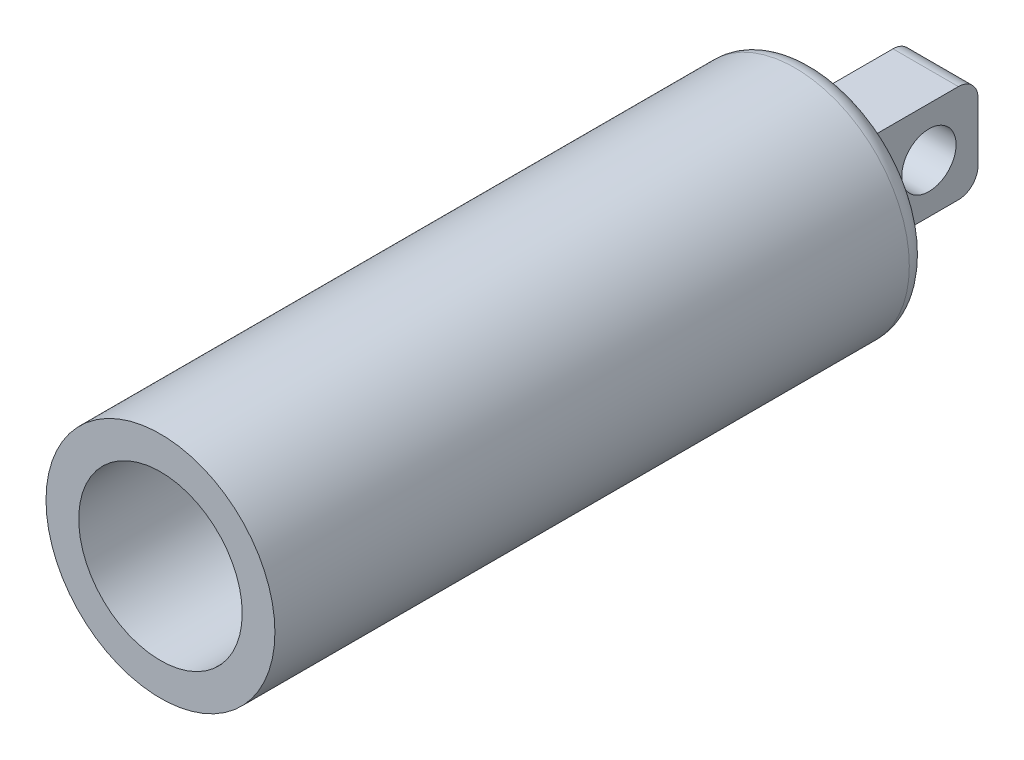
ISO-10303-21;
HEADER;
FILE_DESCRIPTION(('STEP AP214'),'2;1');
FILE_NAME('part.step','',(''),(''),'','','');
FILE_SCHEMA(('AUTOMOTIVE_DESIGN { 1 0 10303 214 1 1 1 1 }'));
ENDSEC;
DATA;
#1=APPLICATION_CONTEXT('core data for automotive mechanical design processes');
#2=APPLICATION_PROTOCOL_DEFINITION('international standard','automotive_design',2000,#1);
#3=PRODUCT_CONTEXT('',#1,'mechanical');
#4=PRODUCT('Part','Part','',(#3));
#5=PRODUCT_RELATED_PRODUCT_CATEGORY('part','',(#4));
#6=PRODUCT_DEFINITION_FORMATION('','',#4);
#7=PRODUCT_DEFINITION_CONTEXT('part definition',#1,'design');
#8=PRODUCT_DEFINITION('design','',#6,#7);
#9=PRODUCT_DEFINITION_SHAPE('','',#8);
#10=(LENGTH_UNIT() NAMED_UNIT(*) SI_UNIT(.MILLI.,.METRE.));
#11=(NAMED_UNIT(*) PLANE_ANGLE_UNIT() SI_UNIT($,.RADIAN.));
#12=(NAMED_UNIT(*) SI_UNIT($,.STERADIAN.) SOLID_ANGLE_UNIT());
#13=UNCERTAINTY_MEASURE_WITH_UNIT(LENGTH_MEASURE(1.E-05),#10,'distance_accuracy_value','');
#14=(GEOMETRIC_REPRESENTATION_CONTEXT(3) GLOBAL_UNCERTAINTY_ASSIGNED_CONTEXT((#13)) GLOBAL_UNIT_ASSIGNED_CONTEXT((#10,
#11,#12)) REPRESENTATION_CONTEXT('',''));
#15=CARTESIAN_POINT('',(0.,0.,0.));
#16=DIRECTION('',(0.,0.,1.));
#17=DIRECTION('',(1.,0.,0.));
#18=AXIS2_PLACEMENT_3D('',#15,#16,#17);
#19=CARTESIAN_POINT('',(0.,0.,100.));
#20=DIRECTION('',(0.,0.,-1.));
#21=DIRECTION('',(-1.,0.,0.));
#22=AXIS2_PLACEMENT_3D('',#19,#20,#21);
#23=CYLINDRICAL_SURFACE('',#22,17.5);
#24=CARTESIAN_POINT('',(0.,0.,3.));
#25=DIRECTION('',(0.,0.,1.));
#26=DIRECTION('',(1.,0.,0.));
#27=AXIS2_PLACEMENT_3D('',#24,#25,#26);
#28=CIRCLE('',#27,17.5);
#29=CARTESIAN_POINT('',(17.5,0.,3.));
#30=VERTEX_POINT('',#29);
#31=EDGE_CURVE('E168',#30,#30,#28,.T.);
#32=ORIENTED_EDGE('',*,*,#31,.T.);
#33=EDGE_LOOP('',(#32));
#34=FACE_BOUND('',#33,.T.);
#35=CARTESIAN_POINT('',(0.,0.,100.));
#36=DIRECTION('',(0.,0.,1.));
#37=DIRECTION('',(1.,0.,0.));
#38=AXIS2_PLACEMENT_3D('',#35,#36,#37);
#39=CIRCLE('',#38,17.5);
#40=CARTESIAN_POINT('',(17.5,0.,100.));
#41=VERTEX_POINT('',#40);
#42=EDGE_CURVE('E129',#41,#41,#39,.T.);
#43=ORIENTED_EDGE('',*,*,#42,.F.);
#44=EDGE_LOOP('',(#43));
#45=FACE_BOUND('',#44,.T.);
#46=ADVANCED_FACE('F39',(#34,#45),#23,.T.);
#47=CARTESIAN_POINT('',(0.,0.,100.));
#48=DIRECTION('',(0.,0.,1.));
#49=DIRECTION('',(1.,0.,0.));
#50=AXIS2_PLACEMENT_3D('',#47,#48,#49);
#51=PLANE('',#50);
#52=CARTESIAN_POINT('',(0.,0.,100.));
#53=DIRECTION('',(0.,0.,1.));
#54=DIRECTION('',(1.,0.,0.));
#55=AXIS2_PLACEMENT_3D('',#52,#53,#54);
#56=CIRCLE('',#55,12.5);
#57=CARTESIAN_POINT('',(12.5,0.,100.));
#58=VERTEX_POINT('',#57);
#59=EDGE_CURVE('E192',#58,#58,#56,.T.);
#60=ORIENTED_EDGE('',*,*,#59,.F.);
#61=EDGE_LOOP('',(#60));
#62=FACE_BOUND('',#61,.T.);
#63=ORIENTED_EDGE('',*,*,#42,.T.);
#64=EDGE_LOOP('',(#63));
#65=FACE_BOUND('',#64,.T.);
#66=ADVANCED_FACE('F246',(#62,#65),#51,.T.);
#67=CARTESIAN_POINT('',(0.,0.,0.));
#68=DIRECTION('',(0.,0.,1.));
#69=DIRECTION('',(1.,0.,0.));
#70=AXIS2_PLACEMENT_3D('',#67,#68,#69);
#71=PLANE('',#70);
#72=CARTESIAN_POINT('',(0.,0.,0.));
#73=DIRECTION('',(0.,0.,1.));
#74=DIRECTION('',(1.,0.,0.));
#75=AXIS2_PLACEMENT_3D('',#72,#73,#74);
#76=CIRCLE('',#75,14.5);
#77=CARTESIAN_POINT('',(14.5,0.,0.));
#78=VERTEX_POINT('',#77);
#79=EDGE_CURVE('E180',#78,#78,#76,.F.);
#80=ORIENTED_EDGE('',*,*,#79,.T.);
#81=EDGE_LOOP('',(#80));
#82=FACE_BOUND('',#81,.T.);
#83=DIRECTION('',(0.,-1.,0.));
#84=VECTOR('',#83,1.);
#85=CARTESIAN_POINT('',(-8.,-7.5,0.));
#86=LINE('',#85,#84);
#87=CARTESIAN_POINT('',(-8.,10.5,0.));
#88=VERTEX_POINT('',#87);
#89=CARTESIAN_POINT('',(-8.,-10.5,0.));
#90=VERTEX_POINT('',#89);
#91=EDGE_CURVE('E118',#88,#90,#86,.T.);
#92=ORIENTED_EDGE('',*,*,#91,.T.);
#93=DIRECTION('',(1.,0.,0.));
#94=VECTOR('',#93,1.);
#95=CARTESIAN_POINT('',(0.,-10.5,0.));
#96=LINE('',#95,#94);
#97=CARTESIAN_POINT('',(8.,-10.5,0.));
#98=VERTEX_POINT('',#97);
#99=EDGE_CURVE('E113',#90,#98,#96,.T.);
#100=ORIENTED_EDGE('',*,*,#99,.T.);
#101=DIRECTION('',(0.,-1.,0.));
#102=VECTOR('',#101,1.);
#103=CARTESIAN_POINT('',(8.,0.,0.));
#104=LINE('',#103,#102);
#105=CARTESIAN_POINT('',(8.,10.5,0.));
#106=VERTEX_POINT('',#105);
#107=EDGE_CURVE('E107',#98,#106,#104,.F.);
#108=ORIENTED_EDGE('',*,*,#107,.T.);
#109=DIRECTION('',(1.,0.,0.));
#110=VECTOR('',#109,1.);
#111=CARTESIAN_POINT('',(0.,10.5,0.));
#112=LINE('',#111,#110);
#113=EDGE_CURVE('E110',#106,#88,#112,.F.);
#114=ORIENTED_EDGE('',*,*,#113,.T.);
#115=EDGE_LOOP('',(#92,#100,#108,#114));
#116=FACE_BOUND('',#115,.T.);
#117=ADVANCED_FACE('F109',(#82,#116),#71,.F.);
#118=CARTESIAN_POINT('',(0.,0.,10.));
#119=DIRECTION('',(0.,0.,1.));
#120=DIRECTION('',(1.,0.,0.));
#121=AXIS2_PLACEMENT_3D('',#118,#119,#120);
#122=CYLINDRICAL_SURFACE('',#121,12.5);
#123=CARTESIAN_POINT('',(0.,0.,10.));
#124=DIRECTION('',(0.,0.,1.));
#125=DIRECTION('',(1.,0.,0.));
#126=AXIS2_PLACEMENT_3D('',#123,#124,#125);
#127=CIRCLE('',#126,12.5);
#128=CARTESIAN_POINT('',(12.5,0.,10.));
#129=VERTEX_POINT('',#128);
#130=EDGE_CURVE('E191',#129,#129,#127,.T.);
#131=ORIENTED_EDGE('',*,*,#130,.F.);
#132=EDGE_LOOP('',(#131));
#133=FACE_BOUND('',#132,.T.);
#134=ORIENTED_EDGE('',*,*,#59,.T.);
#135=EDGE_LOOP('',(#134));
#136=FACE_BOUND('',#135,.T.);
#137=ADVANCED_FACE('F304',(#133,#136),#122,.F.);
#138=CARTESIAN_POINT('',(0.,0.,10.));
#139=DIRECTION('',(0.,0.,1.));
#140=DIRECTION('',(1.,0.,0.));
#141=AXIS2_PLACEMENT_3D('',#138,#139,#140);
#142=PLANE('',#141);
#143=ORIENTED_EDGE('',*,*,#130,.T.);
#144=EDGE_LOOP('',(#143));
#145=FACE_BOUND('',#144,.T.);
#146=ADVANCED_FACE('F298',(#145),#142,.T.);
#147=CARTESIAN_POINT('',(-5.,7.5,-20.));
#148=DIRECTION('',(0.,1.,0.));
#149=DIRECTION('',(0.,0.,1.));
#150=AXIS2_PLACEMENT_3D('',#147,#148,#149);
#151=PLANE('',#150);
#152=DIRECTION('',(0.,0.,1.));
#153=VECTOR('',#152,1.);
#154=CARTESIAN_POINT('',(5.,7.5,-20.));
#155=LINE('',#154,#153);
#156=CARTESIAN_POINT('',(5.,7.5,-17.));
#157=VERTEX_POINT('',#156);
#158=CARTESIAN_POINT('',(5.,7.5,-3.));
#159=VERTEX_POINT('',#158);
#160=EDGE_CURVE('E222',#157,#159,#155,.T.);
#161=ORIENTED_EDGE('',*,*,#160,.F.);
#162=DIRECTION('',(1.,0.,0.));
#163=VECTOR('',#162,1.);
#164=CARTESIAN_POINT('',(-5.,7.5,-17.));
#165=LINE('',#164,#163);
#166=CARTESIAN_POINT('',(-5.,7.5,-17.));
#167=VERTEX_POINT('',#166);
#168=EDGE_CURVE('E11',#157,#167,#165,.F.);
#169=ORIENTED_EDGE('',*,*,#168,.T.);
#170=DIRECTION('',(0.,0.,1.));
#171=VECTOR('',#170,1.);
#172=CARTESIAN_POINT('',(-5.,7.5,-20.));
#173=LINE('',#172,#171);
#174=CARTESIAN_POINT('',(-5.,7.5,-3.));
#175=VERTEX_POINT('',#174);
#176=EDGE_CURVE('E207',#167,#175,#173,.T.);
#177=ORIENTED_EDGE('',*,*,#176,.T.);
#178=DIRECTION('',(1.,0.,0.));
#179=VECTOR('',#178,1.);
#180=CARTESIAN_POINT('',(-5.,7.5,-3.));
#181=LINE('',#180,#179);
#182=EDGE_CURVE('E49',#175,#159,#181,.T.);
#183=ORIENTED_EDGE('',*,*,#182,.T.);
#184=EDGE_LOOP('',(#161,#169,#177,#183));
#185=FACE_BOUND('',#184,.T.);
#186=ADVANCED_FACE('F286',(#185),#151,.T.);
#187=CARTESIAN_POINT('',(-5.,-7.5,-20.));
#188=DIRECTION('',(0.,0.,-1.));
#189=DIRECTION('',(-1.,0.,0.));
#190=AXIS2_PLACEMENT_3D('',#187,#188,#189);
#191=PLANE('',#190);
#192=DIRECTION('',(0.,1.,0.));
#193=VECTOR('',#192,1.);
#194=CARTESIAN_POINT('',(5.,-7.5,-20.));
#195=LINE('',#194,#193);
#196=CARTESIAN_POINT('',(5.,-4.5,-20.));
#197=VERTEX_POINT('',#196);
#198=CARTESIAN_POINT('',(5.,4.5,-20.));
#199=VERTEX_POINT('',#198);
#200=EDGE_CURVE('E214',#197,#199,#195,.T.);
#201=ORIENTED_EDGE('',*,*,#200,.F.);
#202=DIRECTION('',(1.,0.,0.));
#203=VECTOR('',#202,1.);
#204=CARTESIAN_POINT('',(-5.,-4.5,-20.));
#205=LINE('',#204,#203);
#206=CARTESIAN_POINT('',(-5.,-4.5,-20.));
#207=VERTEX_POINT('',#206);
#208=EDGE_CURVE('E153',#197,#207,#205,.F.);
#209=ORIENTED_EDGE('',*,*,#208,.T.);
#210=DIRECTION('',(0.,1.,0.));
#211=VECTOR('',#210,1.);
#212=CARTESIAN_POINT('',(-5.,-7.5,-20.));
#213=LINE('',#212,#211);
#214=CARTESIAN_POINT('',(-5.,4.5,-20.));
#215=VERTEX_POINT('',#214);
#216=EDGE_CURVE('E196',#207,#215,#213,.T.);
#217=ORIENTED_EDGE('',*,*,#216,.T.);
#218=DIRECTION('',(1.,0.,0.));
#219=VECTOR('',#218,1.);
#220=CARTESIAN_POINT('',(-5.,4.5,-20.));
#221=LINE('',#220,#219);
#222=EDGE_CURVE('E156',#215,#199,#221,.T.);
#223=ORIENTED_EDGE('',*,*,#222,.T.);
#224=EDGE_LOOP('',(#201,#209,#217,#223));
#225=FACE_BOUND('',#224,.T.);
#226=ADVANCED_FACE('F290',(#225),#191,.T.);
#227=CARTESIAN_POINT('',(-5.,-7.5,0.));
#228=DIRECTION('',(0.,-1.,0.));
#229=DIRECTION('',(0.,0.,-1.));
#230=AXIS2_PLACEMENT_3D('',#227,#228,#229);
#231=PLANE('',#230);
#232=DIRECTION('',(0.,0.,-1.));
#233=VECTOR('',#232,1.);
#234=CARTESIAN_POINT('',(5.,-7.5,0.));
#235=LINE('',#234,#233);
#236=CARTESIAN_POINT('',(5.,-7.5,-3.));
#237=VERTEX_POINT('',#236);
#238=CARTESIAN_POINT('',(5.,-7.5,-17.));
#239=VERTEX_POINT('',#238);
#240=EDGE_CURVE('E218',#237,#239,#235,.T.);
#241=ORIENTED_EDGE('',*,*,#240,.F.);
#242=DIRECTION('',(1.,0.,0.));
#243=VECTOR('',#242,1.);
#244=CARTESIAN_POINT('',(-5.,-7.5,-3.));
#245=LINE('',#244,#243);
#246=CARTESIAN_POINT('',(-5.,-7.5,-3.));
#247=VERTEX_POINT('',#246);
#248=EDGE_CURVE('E172',#237,#247,#245,.F.);
#249=ORIENTED_EDGE('',*,*,#248,.T.);
#250=DIRECTION('',(0.,0.,-1.));
#251=VECTOR('',#250,1.);
#252=CARTESIAN_POINT('',(-5.,-7.5,0.));
#253=LINE('',#252,#251);
#254=CARTESIAN_POINT('',(-5.,-7.5,-17.));
#255=VERTEX_POINT('',#254);
#256=EDGE_CURVE('E203',#247,#255,#253,.T.);
#257=ORIENTED_EDGE('',*,*,#256,.T.);
#258=DIRECTION('',(1.,0.,0.));
#259=VECTOR('',#258,1.);
#260=CARTESIAN_POINT('',(-5.,-7.5,-17.));
#261=LINE('',#260,#259);
#262=EDGE_CURVE('E176',#255,#239,#261,.T.);
#263=ORIENTED_EDGE('',*,*,#262,.T.);
#264=EDGE_LOOP('',(#241,#249,#257,#263));
#265=FACE_BOUND('',#264,.T.);
#266=ADVANCED_FACE('F282',(#265),#231,.T.);
#267=CARTESIAN_POINT('',(-5.,0.,0.));
#268=DIRECTION('',(1.,0.,0.));
#269=DIRECTION('',(0.,0.,-1.));
#270=AXIS2_PLACEMENT_3D('',#267,#268,#269);
#271=PLANE('',#270);
#272=CARTESIAN_POINT('',(-5.,0.,-12.5));
#273=DIRECTION('',(1.,0.,0.));
#274=DIRECTION('',(0.,0.,-1.));
#275=AXIS2_PLACEMENT_3D('',#272,#273,#274);
#276=CIRCLE('',#275,4.15);
#277=CARTESIAN_POINT('',(-5.,0.,-16.65));
#278=VERTEX_POINT('',#277);
#279=EDGE_CURVE('E210',#278,#278,#276,.T.);
#280=ORIENTED_EDGE('',*,*,#279,.T.);
#281=EDGE_LOOP('',(#280));
#282=FACE_BOUND('',#281,.T.);
#283=ORIENTED_EDGE('',*,*,#216,.F.);
#284=CARTESIAN_POINT('',(-5.,-4.5,-17.));
#285=DIRECTION('',(1.,0.,0.));
#286=DIRECTION('',(0.,0.,-1.));
#287=AXIS2_PLACEMENT_3D('',#284,#285,#286);
#288=CIRCLE('',#287,3.);
#289=EDGE_CURVE('E145',#207,#255,#288,.F.);
#290=ORIENTED_EDGE('',*,*,#289,.T.);
#291=ORIENTED_EDGE('',*,*,#256,.F.);
#292=DIRECTION('',(0.,-1.,0.));
#293=VECTOR('',#292,1.);
#294=CARTESIAN_POINT('',(-5.,7.5,-3.));
#295=LINE('',#294,#293);
#296=EDGE_CURVE('E57',#247,#175,#295,.F.);
#297=ORIENTED_EDGE('',*,*,#296,.T.);
#298=ORIENTED_EDGE('',*,*,#176,.F.);
#299=CARTESIAN_POINT('',(-5.,4.5,-17.));
#300=DIRECTION('',(1.,0.,0.));
#301=DIRECTION('',(0.,0.,-1.));
#302=AXIS2_PLACEMENT_3D('',#299,#300,#301);
#303=CIRCLE('',#302,3.);
#304=EDGE_CURVE('E150',#167,#215,#303,.F.);
#305=ORIENTED_EDGE('',*,*,#304,.T.);
#306=EDGE_LOOP('',(#283,#290,#291,#297,#298,#305));
#307=FACE_BOUND('',#306,.T.);
#308=ADVANCED_FACE('F242',(#282,#307),#271,.F.);
#309=CARTESIAN_POINT('',(-5.,0.,-12.5));
#310=DIRECTION('',(1.,0.,0.));
#311=DIRECTION('',(0.,0.,-1.));
#312=AXIS2_PLACEMENT_3D('',#309,#310,#311);
#313=CYLINDRICAL_SURFACE('',#312,4.15);
#314=ORIENTED_EDGE('',*,*,#279,.F.);
#315=EDGE_LOOP('',(#314));
#316=FACE_BOUND('',#315,.T.);
#317=CARTESIAN_POINT('',(5.,0.,-12.5));
#318=DIRECTION('',(1.,0.,0.));
#319=DIRECTION('',(0.,0.,-1.));
#320=AXIS2_PLACEMENT_3D('',#317,#318,#319);
#321=CIRCLE('',#320,4.15);
#322=CARTESIAN_POINT('',(5.,0.,-16.65));
#323=VERTEX_POINT('',#322);
#324=EDGE_CURVE('E137',#323,#323,#321,.T.);
#325=ORIENTED_EDGE('',*,*,#324,.T.);
#326=EDGE_LOOP('',(#325));
#327=FACE_BOUND('',#326,.T.);
#328=ADVANCED_FACE('F230',(#316,#327),#313,.F.);
#329=CARTESIAN_POINT('',(5.,0.,0.));
#330=DIRECTION('',(1.,0.,0.));
#331=DIRECTION('',(0.,0.,-1.));
#332=AXIS2_PLACEMENT_3D('',#329,#330,#331);
#333=PLANE('',#332);
#334=ORIENTED_EDGE('',*,*,#240,.T.);
#335=CARTESIAN_POINT('',(5.,-4.5,-17.));
#336=DIRECTION('',(1.,0.,0.));
#337=DIRECTION('',(0.,0.,-1.));
#338=AXIS2_PLACEMENT_3D('',#335,#336,#337);
#339=CIRCLE('',#338,3.);
#340=EDGE_CURVE('E160',#239,#197,#339,.T.);
#341=ORIENTED_EDGE('',*,*,#340,.T.);
#342=ORIENTED_EDGE('',*,*,#200,.T.);
#343=CARTESIAN_POINT('',(5.,4.5,-17.));
#344=DIRECTION('',(1.,0.,0.));
#345=DIRECTION('',(0.,0.,-1.));
#346=AXIS2_PLACEMENT_3D('',#343,#344,#345);
#347=CIRCLE('',#346,3.);
#348=EDGE_CURVE('E163',#199,#157,#347,.T.);
#349=ORIENTED_EDGE('',*,*,#348,.T.);
#350=ORIENTED_EDGE('',*,*,#160,.T.);
#351=DIRECTION('',(0.,-1.,0.));
#352=VECTOR('',#351,1.);
#353=CARTESIAN_POINT('',(5.,0.,-3.));
#354=LINE('',#353,#352);
#355=EDGE_CURVE('E132',#159,#237,#354,.T.);
#356=ORIENTED_EDGE('',*,*,#355,.T.);
#357=EDGE_LOOP('',(#334,#341,#342,#349,#350,#356));
#358=FACE_BOUND('',#357,.T.);
#359=ORIENTED_EDGE('',*,*,#324,.F.);
#360=EDGE_LOOP('',(#359));
#361=FACE_BOUND('',#360,.T.);
#362=ADVANCED_FACE('F232',(#358,#361),#333,.T.);
#363=CARTESIAN_POINT('',(-5.,10.5,-3.));
#364=DIRECTION('',(1.,0.,0.));
#365=DIRECTION('',(0.,0.,-1.));
#366=AXIS2_PLACEMENT_3D('',#363,#364,#365);
#367=CYLINDRICAL_SURFACE('',#366,3.);
#368=CARTESIAN_POINT('',(8.,10.5,-3.));
#369=DIRECTION('',(0.707106781186547,-0.707106781186547,0.));
#370=DIRECTION('',(0.707106781186547,0.707106781186547,0.));
#371=AXIS2_PLACEMENT_3D('',#368,#369,#370);
#372=ELLIPSE('',#371,4.24264068711928,3.);
#373=EDGE_CURVE('E124',#159,#106,#372,.F.);
#374=ORIENTED_EDGE('',*,*,#373,.F.);
#375=ORIENTED_EDGE('',*,*,#182,.F.);
#376=CARTESIAN_POINT('',(-8.,10.5,-3.));
#377=DIRECTION('',(0.707106781186547,0.707106781186547,0.));
#378=DIRECTION('',(0.707106781186547,-0.707106781186547,0.));
#379=AXIS2_PLACEMENT_3D('',#376,#377,#378);
#380=ELLIPSE('',#379,4.24264068711928,3.);
#381=EDGE_CURVE('E43',#88,#175,#380,.T.);
#382=ORIENTED_EDGE('',*,*,#381,.F.);
#383=ORIENTED_EDGE('',*,*,#113,.F.);
#384=EDGE_LOOP('',(#374,#375,#382,#383));
#385=FACE_BOUND('',#384,.T.);
#386=ADVANCED_FACE('F122',(#385),#367,.F.);
#387=CARTESIAN_POINT('',(-8.,0.,-3.));
#388=DIRECTION('',(0.,1.,0.));
#389=DIRECTION('',(0.,0.,1.));
#390=AXIS2_PLACEMENT_3D('',#387,#388,#389);
#391=CYLINDRICAL_SURFACE('',#390,3.);
#392=ORIENTED_EDGE('',*,*,#381,.T.);
#393=ORIENTED_EDGE('',*,*,#296,.F.);
#394=CARTESIAN_POINT('',(-8.,-10.5,-3.));
#395=DIRECTION('',(-0.707106781186547,0.707106781186547,0.));
#396=DIRECTION('',(0.707106781186547,0.707106781186547,0.));
#397=AXIS2_PLACEMENT_3D('',#394,#395,#396);
#398=ELLIPSE('',#397,4.24264068711928,3.);
#399=EDGE_CURVE('E134',#90,#247,#398,.T.);
#400=ORIENTED_EDGE('',*,*,#399,.F.);
#401=ORIENTED_EDGE('',*,*,#91,.F.);
#402=EDGE_LOOP('',(#392,#393,#400,#401));
#403=FACE_BOUND('',#402,.T.);
#404=ADVANCED_FACE('F240',(#403),#391,.F.);
#405=CARTESIAN_POINT('',(8.,0.,-3.));
#406=DIRECTION('',(0.,-1.,0.));
#407=DIRECTION('',(0.,0.,-1.));
#408=AXIS2_PLACEMENT_3D('',#405,#406,#407);
#409=CYLINDRICAL_SURFACE('',#408,3.);
#410=ORIENTED_EDGE('',*,*,#373,.T.);
#411=ORIENTED_EDGE('',*,*,#107,.F.);
#412=CARTESIAN_POINT('',(8.,-10.5,-3.));
#413=DIRECTION('',(-0.707106781186547,-0.707106781186547,0.));
#414=DIRECTION('',(0.707106781186547,-0.707106781186547,0.));
#415=AXIS2_PLACEMENT_3D('',#412,#413,#414);
#416=ELLIPSE('',#415,4.24264068711928,3.);
#417=EDGE_CURVE('E138',#237,#98,#416,.F.);
#418=ORIENTED_EDGE('',*,*,#417,.F.);
#419=ORIENTED_EDGE('',*,*,#355,.F.);
#420=EDGE_LOOP('',(#410,#411,#418,#419));
#421=FACE_BOUND('',#420,.T.);
#422=ADVANCED_FACE('F131',(#421),#409,.F.);
#423=CARTESIAN_POINT('',(0.,-10.5,-3.));
#424=DIRECTION('',(1.,0.,0.));
#425=DIRECTION('',(0.,0.,-1.));
#426=AXIS2_PLACEMENT_3D('',#423,#424,#425);
#427=CYLINDRICAL_SURFACE('',#426,3.);
#428=ORIENTED_EDGE('',*,*,#399,.T.);
#429=ORIENTED_EDGE('',*,*,#248,.F.);
#430=ORIENTED_EDGE('',*,*,#417,.T.);
#431=ORIENTED_EDGE('',*,*,#99,.F.);
#432=EDGE_LOOP('',(#428,#429,#430,#431));
#433=FACE_BOUND('',#432,.T.);
#434=ADVANCED_FACE('F257',(#433),#427,.F.);
#435=CARTESIAN_POINT('',(0.,0.,3.));
#436=DIRECTION('',(0.,0.,1.));
#437=DIRECTION('',(1.,0.,0.));
#438=AXIS2_PLACEMENT_3D('',#435,#436,#437);
#439=TOROIDAL_SURFACE('',#438,14.5,3.);
#440=ORIENTED_EDGE('',*,*,#79,.F.);
#441=EDGE_LOOP('',(#440));
#442=FACE_BOUND('',#441,.T.);
#443=ORIENTED_EDGE('',*,*,#31,.F.);
#444=EDGE_LOOP('',(#443));
#445=FACE_BOUND('',#444,.T.);
#446=ADVANCED_FACE('F260',(#442,#445),#439,.T.);
#447=CARTESIAN_POINT('',(-5.,-4.5,-17.));
#448=DIRECTION('',(1.,0.,0.));
#449=DIRECTION('',(0.,0.,-1.));
#450=AXIS2_PLACEMENT_3D('',#447,#448,#449);
#451=CYLINDRICAL_SURFACE('',#450,3.);
#452=ORIENTED_EDGE('',*,*,#289,.F.);
#453=ORIENTED_EDGE('',*,*,#208,.F.);
#454=ORIENTED_EDGE('',*,*,#340,.F.);
#455=ORIENTED_EDGE('',*,*,#262,.F.);
#456=EDGE_LOOP('',(#452,#453,#454,#455));
#457=FACE_BOUND('',#456,.T.);
#458=ADVANCED_FACE('F268',(#457),#451,.T.);
#459=CARTESIAN_POINT('',(-5.,4.5,-17.));
#460=DIRECTION('',(1.,0.,0.));
#461=DIRECTION('',(0.,0.,-1.));
#462=AXIS2_PLACEMENT_3D('',#459,#460,#461);
#463=CYLINDRICAL_SURFACE('',#462,3.);
#464=ORIENTED_EDGE('',*,*,#304,.F.);
#465=ORIENTED_EDGE('',*,*,#168,.F.);
#466=ORIENTED_EDGE('',*,*,#348,.F.);
#467=ORIENTED_EDGE('',*,*,#222,.F.);
#468=EDGE_LOOP('',(#464,#465,#466,#467));
#469=FACE_BOUND('',#468,.T.);
#470=ADVANCED_FACE('F41',(#469),#463,.T.);
#471=CLOSED_SHELL('',(#46,#66,#117,#137,#146,#186,#226,#266,#308,#328,#362,#386,#404,#422,#434,
#446,#458,#470));
#472=MANIFOLD_SOLID_BREP('B2',#471);
#473=ADVANCED_BREP_SHAPE_REPRESENTATION('',(#18,#472),#14);
#474=SHAPE_DEFINITION_REPRESENTATION(#9,#473);
ENDSEC;
END-ISO-10303-21;
